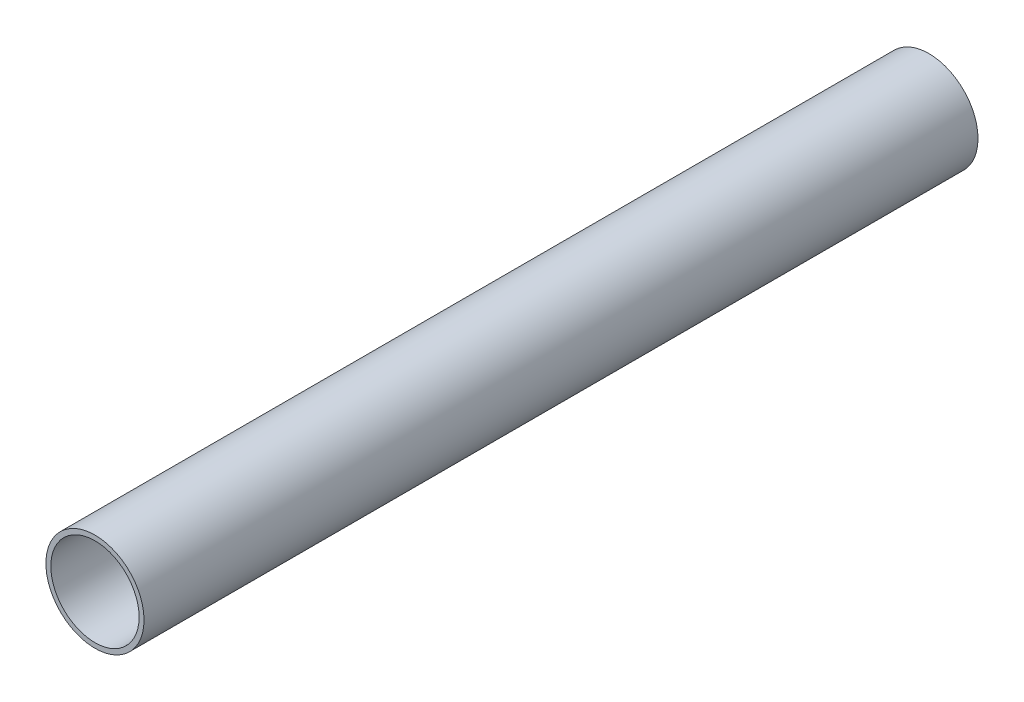
ISO-10303-21;
HEADER;
FILE_DESCRIPTION(('STEP AP214'),'2;1');
FILE_NAME('part.step','',(''),(''),'','','');
FILE_SCHEMA(('AUTOMOTIVE_DESIGN { 1 0 10303 214 1 1 1 1 }'));
ENDSEC;
DATA;
#1=APPLICATION_CONTEXT('core data for automotive mechanical design processes');
#2=APPLICATION_PROTOCOL_DEFINITION('international standard','automotive_design',2000,#1);
#3=PRODUCT_CONTEXT('',#1,'mechanical');
#4=PRODUCT('Part','Part','',(#3));
#5=PRODUCT_RELATED_PRODUCT_CATEGORY('part','',(#4));
#6=PRODUCT_DEFINITION_FORMATION('','',#4);
#7=PRODUCT_DEFINITION_CONTEXT('part definition',#1,'design');
#8=PRODUCT_DEFINITION('design','',#6,#7);
#9=PRODUCT_DEFINITION_SHAPE('','',#8);
#10=(LENGTH_UNIT() NAMED_UNIT(*) SI_UNIT(.MILLI.,.METRE.));
#11=(NAMED_UNIT(*) PLANE_ANGLE_UNIT() SI_UNIT($,.RADIAN.));
#12=(NAMED_UNIT(*) SI_UNIT($,.STERADIAN.) SOLID_ANGLE_UNIT());
#13=UNCERTAINTY_MEASURE_WITH_UNIT(LENGTH_MEASURE(1.E-05),#10,'distance_accuracy_value','');
#14=(GEOMETRIC_REPRESENTATION_CONTEXT(3) GLOBAL_UNCERTAINTY_ASSIGNED_CONTEXT((#13)) GLOBAL_UNIT_ASSIGNED_CONTEXT((#10,
#11,#12)) REPRESENTATION_CONTEXT('',''));
#15=CARTESIAN_POINT('',(0.,0.,0.));
#16=DIRECTION('',(0.,0.,1.));
#17=DIRECTION('',(1.,0.,0.));
#18=AXIS2_PLACEMENT_3D('',#15,#16,#17);
#19=CARTESIAN_POINT('',(0.,0.,170.));
#20=DIRECTION('',(0.,0.,1.));
#21=DIRECTION('',(1.,0.,0.));
#22=AXIS2_PLACEMENT_3D('',#19,#20,#21);
#23=PLANE('',#22);
#24=CARTESIAN_POINT('',(0.,0.,170.));
#25=DIRECTION('',(0.,0.,1.));
#26=DIRECTION('',(1.,0.,0.));
#27=AXIS2_PLACEMENT_3D('',#24,#25,#26);
#28=CIRCLE('',#27,10.);
#29=CARTESIAN_POINT('',(10.,0.,170.));
#30=VERTEX_POINT('',#29);
#31=EDGE_CURVE('E10',#30,#30,#28,.T.);
#32=ORIENTED_EDGE('',*,*,#31,.T.);
#33=EDGE_LOOP('',(#32));
#34=FACE_BOUND('',#33,.T.);
#35=CARTESIAN_POINT('',(0.,0.,170.));
#36=DIRECTION('',(0.,0.,1.));
#37=DIRECTION('',(1.,0.,0.));
#38=AXIS2_PLACEMENT_3D('',#35,#36,#37);
#39=CIRCLE('',#38,9.);
#40=CARTESIAN_POINT('',(9.,0.,170.));
#41=VERTEX_POINT('',#40);
#42=EDGE_CURVE('E48',#41,#41,#39,.T.);
#43=ORIENTED_EDGE('',*,*,#42,.F.);
#44=EDGE_LOOP('',(#43));
#45=FACE_BOUND('',#44,.T.);
#46=ADVANCED_FACE('F37',(#34,#45),#23,.T.);
#47=CARTESIAN_POINT('',(0.,0.,0.));
#48=DIRECTION('',(0.,0.,1.));
#49=DIRECTION('',(1.,0.,0.));
#50=AXIS2_PLACEMENT_3D('',#47,#48,#49);
#51=PLANE('',#50);
#52=CARTESIAN_POINT('',(0.,0.,0.));
#53=DIRECTION('',(0.,0.,1.));
#54=DIRECTION('',(1.,0.,0.));
#55=AXIS2_PLACEMENT_3D('',#52,#53,#54);
#56=CIRCLE('',#55,10.);
#57=CARTESIAN_POINT('',(10.,0.,0.));
#58=VERTEX_POINT('',#57);
#59=EDGE_CURVE('E41',#58,#58,#56,.T.);
#60=ORIENTED_EDGE('',*,*,#59,.F.);
#61=EDGE_LOOP('',(#60));
#62=FACE_BOUND('',#61,.T.);
#63=CARTESIAN_POINT('',(0.,0.,0.));
#64=DIRECTION('',(0.,0.,1.));
#65=DIRECTION('',(1.,0.,0.));
#66=AXIS2_PLACEMENT_3D('',#63,#64,#65);
#67=CIRCLE('',#66,9.);
#68=CARTESIAN_POINT('',(9.,0.,0.));
#69=VERTEX_POINT('',#68);
#70=EDGE_CURVE('E50',#69,#69,#67,.T.);
#71=ORIENTED_EDGE('',*,*,#70,.T.);
#72=EDGE_LOOP('',(#71));
#73=FACE_BOUND('',#72,.T.);
#74=ADVANCED_FACE('F60',(#62,#73),#51,.F.);
#75=CARTESIAN_POINT('',(0.,0.,170.));
#76=DIRECTION('',(0.,0.,-1.));
#77=DIRECTION('',(-1.,0.,0.));
#78=AXIS2_PLACEMENT_3D('',#75,#76,#77);
#79=CYLINDRICAL_SURFACE('',#78,10.);
#80=ORIENTED_EDGE('',*,*,#31,.F.);
#81=EDGE_LOOP('',(#80));
#82=FACE_BOUND('',#81,.T.);
#83=ORIENTED_EDGE('',*,*,#59,.T.);
#84=EDGE_LOOP('',(#83));
#85=FACE_BOUND('',#84,.T.);
#86=ADVANCED_FACE('F39',(#82,#85),#79,.T.);
#87=CARTESIAN_POINT('',(0.,0.,170.));
#88=DIRECTION('',(0.,0.,-1.));
#89=DIRECTION('',(-1.,0.,0.));
#90=AXIS2_PLACEMENT_3D('',#87,#88,#89);
#91=CYLINDRICAL_SURFACE('',#90,9.);
#92=ORIENTED_EDGE('',*,*,#42,.T.);
#93=EDGE_LOOP('',(#92));
#94=FACE_BOUND('',#93,.T.);
#95=ORIENTED_EDGE('',*,*,#70,.F.);
#96=EDGE_LOOP('',(#95));
#97=FACE_BOUND('',#96,.T.);
#98=ADVANCED_FACE('F56',(#94,#97),#91,.F.);
#99=CLOSED_SHELL('',(#46,#74,#86,#98));
#100=MANIFOLD_SOLID_BREP('B2',#99);
#101=ADVANCED_BREP_SHAPE_REPRESENTATION('',(#18,#100),#14);
#102=SHAPE_DEFINITION_REPRESENTATION(#9,#101);
ENDSEC;
END-ISO-10303-21;
